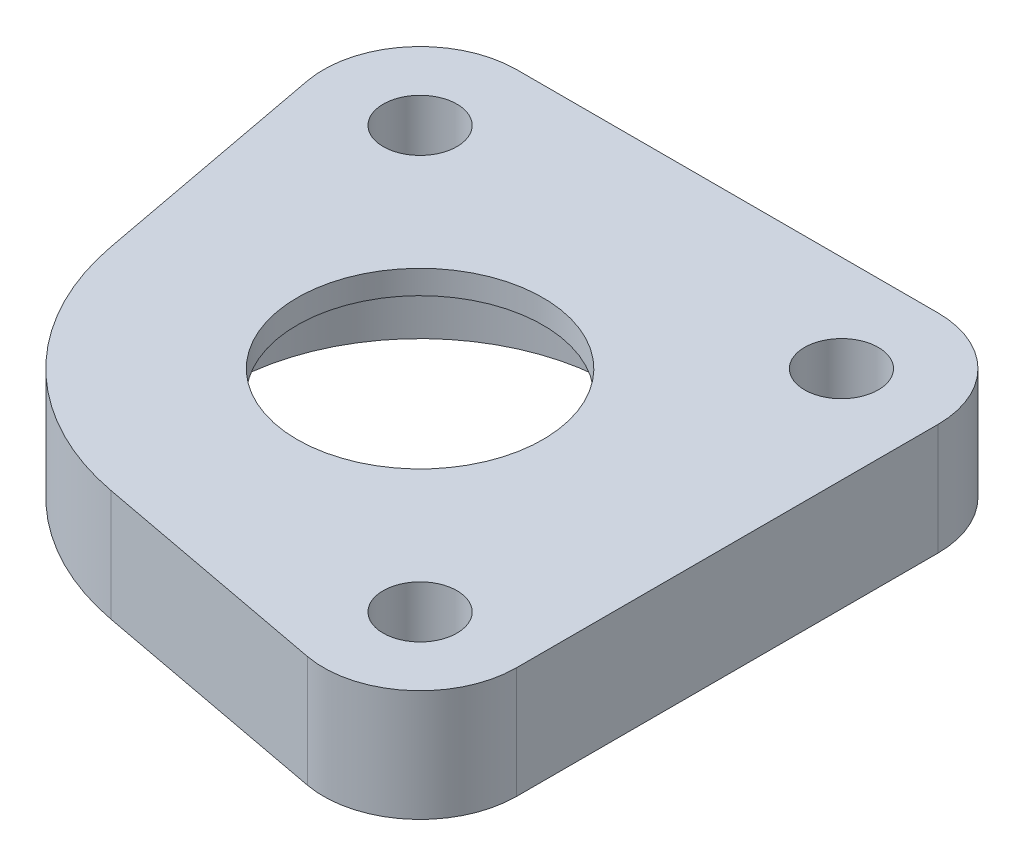
ISO-10303-21;
HEADER;
FILE_DESCRIPTION(('STEP AP214'),'2;1');
FILE_NAME('part.step','',(''),(''),'','','');
FILE_SCHEMA(('AUTOMOTIVE_DESIGN { 1 0 10303 214 1 1 1 1 }'));
ENDSEC;
DATA;
#1=APPLICATION_CONTEXT('core data for automotive mechanical design processes');
#2=APPLICATION_PROTOCOL_DEFINITION('international standard','automotive_design',2000,#1);
#3=PRODUCT_CONTEXT('',#1,'mechanical');
#4=PRODUCT('Part','Part','',(#3));
#5=PRODUCT_RELATED_PRODUCT_CATEGORY('part','',(#4));
#6=PRODUCT_DEFINITION_FORMATION('','',#4);
#7=PRODUCT_DEFINITION_CONTEXT('part definition',#1,'design');
#8=PRODUCT_DEFINITION('design','',#6,#7);
#9=PRODUCT_DEFINITION_SHAPE('','',#8);
#10=(LENGTH_UNIT() NAMED_UNIT(*) SI_UNIT(.MILLI.,.METRE.));
#11=(NAMED_UNIT(*) PLANE_ANGLE_UNIT() SI_UNIT($,.RADIAN.));
#12=(NAMED_UNIT(*) SI_UNIT($,.STERADIAN.) SOLID_ANGLE_UNIT());
#13=UNCERTAINTY_MEASURE_WITH_UNIT(LENGTH_MEASURE(1.E-05),#10,'distance_accuracy_value','');
#14=(GEOMETRIC_REPRESENTATION_CONTEXT(3) GLOBAL_UNCERTAINTY_ASSIGNED_CONTEXT((#13)) GLOBAL_UNIT_ASSIGNED_CONTEXT((#10,
#11,#12)) REPRESENTATION_CONTEXT('',''));
#15=CARTESIAN_POINT('',(0.,0.,0.));
#16=DIRECTION('',(0.,0.,1.));
#17=DIRECTION('',(1.,0.,0.));
#18=AXIS2_PLACEMENT_3D('',#15,#16,#17);
#19=CARTESIAN_POINT('',(12.,6.35,-12.));
#20=DIRECTION('',(0.,1.,0.));
#21=DIRECTION('',(0.,0.,1.));
#22=AXIS2_PLACEMENT_3D('',#19,#20,#21);
#23=PLANE('',#22);
#24=CARTESIAN_POINT('',(12.,6.35,-12.));
#25=DIRECTION('',(0.,1.,0.));
#26=DIRECTION('',(0.,0.,1.));
#27=AXIS2_PLACEMENT_3D('',#24,#25,#26);
#28=CIRCLE('',#27,2.09999999999999);
#29=CARTESIAN_POINT('',(12.,6.35,-9.90000000000001));
#30=VERTEX_POINT('',#29);
#31=EDGE_CURVE('E235',#30,#30,#28,.T.);
#32=ORIENTED_EDGE('',*,*,#31,.F.);
#33=EDGE_LOOP('',(#32));
#34=FACE_BOUND('',#33,.T.);
#35=CARTESIAN_POINT('',(12.,6.35,12.));
#36=DIRECTION('',(0.,1.,0.));
#37=DIRECTION('',(0.,0.,1.));
#38=AXIS2_PLACEMENT_3D('',#35,#36,#37);
#39=CIRCLE('',#38,2.09999999999999);
#40=CARTESIAN_POINT('',(12.,6.35,14.1));
#41=VERTEX_POINT('',#40);
#42=EDGE_CURVE('E229',#41,#41,#39,.T.);
#43=ORIENTED_EDGE('',*,*,#42,.F.);
#44=EDGE_LOOP('',(#43));
#45=FACE_BOUND('',#44,.T.);
#46=CARTESIAN_POINT('',(-12.,6.35,-12.));
#47=DIRECTION('',(0.,1.,0.));
#48=DIRECTION('',(0.,0.,1.));
#49=AXIS2_PLACEMENT_3D('',#46,#47,#48);
#50=CIRCLE('',#49,2.09999999999999);
#51=CARTESIAN_POINT('',(-12.,6.35,-9.90000000000001));
#52=VERTEX_POINT('',#51);
#53=EDGE_CURVE('E223',#52,#52,#50,.T.);
#54=ORIENTED_EDGE('',*,*,#53,.F.);
#55=EDGE_LOOP('',(#54));
#56=FACE_BOUND('',#55,.T.);
#57=DIRECTION('',(1.,0.,0.));
#58=VECTOR('',#57,1.);
#59=CARTESIAN_POINT('',(-12.,6.35,-17.5));
#60=LINE('',#59,#58);
#61=CARTESIAN_POINT('',(-12.,6.35,-17.5));
#62=VERTEX_POINT('',#61);
#63=CARTESIAN_POINT('',(12.,6.35,-17.5));
#64=VERTEX_POINT('',#63);
#65=EDGE_CURVE('E181',#62,#64,#60,.T.);
#66=ORIENTED_EDGE('',*,*,#65,.F.);
#67=CARTESIAN_POINT('',(-12.,6.35,-12.));
#68=DIRECTION('',(0.,1.,0.));
#69=DIRECTION('',(0.,0.,1.));
#70=AXIS2_PLACEMENT_3D('',#67,#68,#69);
#71=CIRCLE('',#70,5.5);
#72=CARTESIAN_POINT('',(-17.4052170349977,6.35,-10.983324631669));
#73=VERTEX_POINT('',#72);
#74=EDGE_CURVE('E139',#62,#73,#71,.T.);
#75=ORIENTED_EDGE('',*,*,#74,.T.);
#76=DIRECTION('',(0.184850066969274,0.,0.98276673363594));
#77=VECTOR('',#76,1.);
#78=CARTESIAN_POINT('',(-17.4052170349977,6.35,-10.983324631669));
#79=LINE('',#78,#77);
#80=CARTESIAN_POINT('',(-14.8152085095618,6.35,2.7866147595618));
#81=VERTEX_POINT('',#80);
#82=EDGE_CURVE('E132',#73,#81,#79,.T.);
#83=ORIENTED_EDGE('',*,*,#82,.T.);
#84=CARTESIAN_POINT('',(0.,6.35,0.));
#85=DIRECTION('',(0.,1.,0.));
#86=DIRECTION('',(0.,0.,1.));
#87=AXIS2_PLACEMENT_3D('',#84,#85,#86);
#88=CIRCLE('',#87,15.075);
#89=CARTESIAN_POINT('',(-2.7866147595618,6.35,14.8152085095618));
#90=VERTEX_POINT('',#89);
#91=EDGE_CURVE('E137',#81,#90,#88,.T.);
#92=ORIENTED_EDGE('',*,*,#91,.T.);
#93=DIRECTION('',(-0.98276673363594,0.,-0.184850066969274));
#94=VECTOR('',#93,1.);
#95=CARTESIAN_POINT('',(10.983324631669,6.35,17.4052170349977));
#96=LINE('',#95,#94);
#97=CARTESIAN_POINT('',(10.983324631669,6.35,17.4052170349977));
#98=VERTEX_POINT('',#97);
#99=EDGE_CURVE('E154',#98,#90,#96,.T.);
#100=ORIENTED_EDGE('',*,*,#99,.F.);
#101=CARTESIAN_POINT('',(12.,6.35,12.));
#102=DIRECTION('',(0.,1.,0.));
#103=DIRECTION('',(0.,0.,1.));
#104=AXIS2_PLACEMENT_3D('',#101,#102,#103);
#105=CIRCLE('',#104,5.5);
#106=CARTESIAN_POINT('',(17.5,6.35,12.));
#107=VERTEX_POINT('',#106);
#108=EDGE_CURVE('E156',#98,#107,#105,.T.);
#109=ORIENTED_EDGE('',*,*,#108,.T.);
#110=DIRECTION('',(0.,0.,1.));
#111=VECTOR('',#110,1.);
#112=CARTESIAN_POINT('',(17.5000000000001,6.35,-12.));
#113=LINE('',#112,#111);
#114=CARTESIAN_POINT('',(17.5000000000001,6.35,-12.));
#115=VERTEX_POINT('',#114);
#116=EDGE_CURVE('E203',#115,#107,#113,.T.);
#117=ORIENTED_EDGE('',*,*,#116,.F.);
#118=CARTESIAN_POINT('',(12.,6.35,-12.));
#119=DIRECTION('',(0.,1.,0.));
#120=DIRECTION('',(0.,0.,1.));
#121=AXIS2_PLACEMENT_3D('',#118,#119,#120);
#122=CIRCLE('',#121,5.50000000000003);
#123=EDGE_CURVE('E117',#115,#64,#122,.T.);
#124=ORIENTED_EDGE('',*,*,#123,.T.);
#125=EDGE_LOOP('',(#66,#75,#83,#92,#100,#109,#117,#124));
#126=FACE_BOUND('',#125,.T.);
#127=CARTESIAN_POINT('',(0.,6.35,0.));
#128=DIRECTION('',(0.,1.,0.));
#129=DIRECTION('',(0.,0.,1.));
#130=AXIS2_PLACEMENT_3D('',#127,#128,#129);
#131=CIRCLE('',#130,7.);
#132=CARTESIAN_POINT('',(0.,6.35,7.));
#133=VERTEX_POINT('',#132);
#134=EDGE_CURVE('E166',#133,#133,#131,.T.);
#135=ORIENTED_EDGE('',*,*,#134,.F.);
#136=EDGE_LOOP('',(#135));
#137=FACE_BOUND('',#136,.T.);
#138=ADVANCED_FACE('F61',(#34,#45,#56,#126,#137),#23,.T.);
#139=CARTESIAN_POINT('',(12.,0.,-12.));
#140=DIRECTION('',(0.,1.,0.));
#141=DIRECTION('',(0.,0.,1.));
#142=AXIS2_PLACEMENT_3D('',#139,#140,#141);
#143=PLANE('',#142);
#144=CARTESIAN_POINT('',(12.,0.,-12.));
#145=DIRECTION('',(0.,1.,0.));
#146=DIRECTION('',(0.,0.,1.));
#147=AXIS2_PLACEMENT_3D('',#144,#145,#146);
#148=CIRCLE('',#147,2.1);
#149=CARTESIAN_POINT('',(12.,0.,-9.9));
#150=VERTEX_POINT('',#149);
#151=EDGE_CURVE('E232',#150,#150,#148,.T.);
#152=ORIENTED_EDGE('',*,*,#151,.T.);
#153=EDGE_LOOP('',(#152));
#154=FACE_BOUND('',#153,.T.);
#155=CARTESIAN_POINT('',(12.,0.,12.));
#156=DIRECTION('',(0.,1.,0.));
#157=DIRECTION('',(0.,0.,1.));
#158=AXIS2_PLACEMENT_3D('',#155,#156,#157);
#159=CIRCLE('',#158,2.1);
#160=CARTESIAN_POINT('',(12.,0.,14.1));
#161=VERTEX_POINT('',#160);
#162=EDGE_CURVE('E226',#161,#161,#159,.T.);
#163=ORIENTED_EDGE('',*,*,#162,.T.);
#164=EDGE_LOOP('',(#163));
#165=FACE_BOUND('',#164,.T.);
#166=CARTESIAN_POINT('',(-12.,0.,-12.));
#167=DIRECTION('',(0.,1.,0.));
#168=DIRECTION('',(0.,0.,1.));
#169=AXIS2_PLACEMENT_3D('',#166,#167,#168);
#170=CIRCLE('',#169,2.1);
#171=CARTESIAN_POINT('',(-12.,0.,-9.9));
#172=VERTEX_POINT('',#171);
#173=EDGE_CURVE('E218',#172,#172,#170,.T.);
#174=ORIENTED_EDGE('',*,*,#173,.T.);
#175=EDGE_LOOP('',(#174));
#176=FACE_BOUND('',#175,.T.);
#177=CARTESIAN_POINT('',(0.,0.,0.));
#178=DIRECTION('',(0.,1.,0.));
#179=DIRECTION('',(0.,0.,1.));
#180=AXIS2_PLACEMENT_3D('',#177,#178,#179);
#181=CIRCLE('',#180,11.075);
#182=CARTESIAN_POINT('',(0.,0.,11.075));
#183=VERTEX_POINT('',#182);
#184=EDGE_CURVE('E214',#183,#183,#181,.T.);
#185=ORIENTED_EDGE('',*,*,#184,.T.);
#186=EDGE_LOOP('',(#185));
#187=FACE_BOUND('',#186,.T.);
#188=DIRECTION('',(1.,0.,0.));
#189=VECTOR('',#188,1.);
#190=CARTESIAN_POINT('',(-12.,0.,-17.5));
#191=LINE('',#190,#189);
#192=CARTESIAN_POINT('',(-12.,0.,-17.5));
#193=VERTEX_POINT('',#192);
#194=CARTESIAN_POINT('',(12.,0.,-17.5));
#195=VERTEX_POINT('',#194);
#196=EDGE_CURVE('E162',#193,#195,#191,.T.);
#197=ORIENTED_EDGE('',*,*,#196,.T.);
#198=CARTESIAN_POINT('',(12.,0.,-12.));
#199=DIRECTION('',(0.,1.,0.));
#200=DIRECTION('',(0.,0.,1.));
#201=AXIS2_PLACEMENT_3D('',#198,#199,#200);
#202=CIRCLE('',#201,5.50000000000003);
#203=CARTESIAN_POINT('',(17.5000000000001,0.,-12.));
#204=VERTEX_POINT('',#203);
#205=EDGE_CURVE('E165',#204,#195,#202,.T.);
#206=ORIENTED_EDGE('',*,*,#205,.F.);
#207=DIRECTION('',(0.,0.,1.));
#208=VECTOR('',#207,1.);
#209=CARTESIAN_POINT('',(17.5000000000001,0.,-12.));
#210=LINE('',#209,#208);
#211=CARTESIAN_POINT('',(17.5,0.,12.));
#212=VERTEX_POINT('',#211);
#213=EDGE_CURVE('E169',#204,#212,#210,.T.);
#214=ORIENTED_EDGE('',*,*,#213,.T.);
#215=CARTESIAN_POINT('',(12.,0.,12.));
#216=DIRECTION('',(0.,1.,0.));
#217=DIRECTION('',(0.,0.,1.));
#218=AXIS2_PLACEMENT_3D('',#215,#216,#217);
#219=CIRCLE('',#218,5.5);
#220=CARTESIAN_POINT('',(10.983324631669,0.,17.4052170349977));
#221=VERTEX_POINT('',#220);
#222=EDGE_CURVE('E172',#221,#212,#219,.T.);
#223=ORIENTED_EDGE('',*,*,#222,.F.);
#224=DIRECTION('',(-0.98276673363594,0.,-0.184850066969274));
#225=VECTOR('',#224,1.);
#226=CARTESIAN_POINT('',(10.983324631669,0.,17.4052170349977));
#227=LINE('',#226,#225);
#228=CARTESIAN_POINT('',(-2.7866147595618,0.,14.8152085095618));
#229=VERTEX_POINT('',#228);
#230=EDGE_CURVE('E175',#221,#229,#227,.T.);
#231=ORIENTED_EDGE('',*,*,#230,.T.);
#232=CARTESIAN_POINT('',(0.,0.,0.));
#233=DIRECTION('',(0.,1.,0.));
#234=DIRECTION('',(0.,0.,1.));
#235=AXIS2_PLACEMENT_3D('',#232,#233,#234);
#236=CIRCLE('',#235,15.075);
#237=CARTESIAN_POINT('',(-14.8152085095618,0.,2.7866147595618));
#238=VERTEX_POINT('',#237);
#239=EDGE_CURVE('E178',#238,#229,#236,.T.);
#240=ORIENTED_EDGE('',*,*,#239,.F.);
#241=DIRECTION('',(0.184850066969274,0.,0.98276673363594));
#242=VECTOR('',#241,1.);
#243=CARTESIAN_POINT('',(-17.4052170349977,0.,-10.983324631669));
#244=LINE('',#243,#242);
#245=CARTESIAN_POINT('',(-17.4052170349977,0.,-10.983324631669));
#246=VERTEX_POINT('',#245);
#247=EDGE_CURVE('E146',#246,#238,#244,.T.);
#248=ORIENTED_EDGE('',*,*,#247,.F.);
#249=CARTESIAN_POINT('',(-12.,0.,-12.));
#250=DIRECTION('',(0.,1.,0.));
#251=DIRECTION('',(0.,0.,1.));
#252=AXIS2_PLACEMENT_3D('',#249,#250,#251);
#253=CIRCLE('',#252,5.5);
#254=EDGE_CURVE('E107',#193,#246,#253,.T.);
#255=ORIENTED_EDGE('',*,*,#254,.F.);
#256=EDGE_LOOP('',(#197,#206,#214,#223,#231,#240,#248,#255));
#257=FACE_BOUND('',#256,.T.);
#258=ADVANCED_FACE('F195',(#154,#165,#176,#187,#257),#143,.F.);
#259=CARTESIAN_POINT('',(-12.,6.35,-17.5));
#260=DIRECTION('',(0.,0.,-1.));
#261=DIRECTION('',(-1.,0.,0.));
#262=AXIS2_PLACEMENT_3D('',#259,#260,#261);
#263=PLANE('',#262);
#264=ORIENTED_EDGE('',*,*,#196,.F.);
#265=DIRECTION('',(0.,-1.,0.));
#266=VECTOR('',#265,1.);
#267=CARTESIAN_POINT('',(-12.,6.35,-17.5));
#268=LINE('',#267,#266);
#269=EDGE_CURVE('E12',#62,#193,#268,.T.);
#270=ORIENTED_EDGE('',*,*,#269,.F.);
#271=ORIENTED_EDGE('',*,*,#65,.T.);
#272=DIRECTION('',(0.,-1.,0.));
#273=VECTOR('',#272,1.);
#274=CARTESIAN_POINT('',(12.,6.35,-17.5));
#275=LINE('',#274,#273);
#276=EDGE_CURVE('E161',#64,#195,#275,.T.);
#277=ORIENTED_EDGE('',*,*,#276,.T.);
#278=EDGE_LOOP('',(#264,#270,#271,#277));
#279=FACE_BOUND('',#278,.T.);
#280=ADVANCED_FACE('F63',(#279),#263,.T.);
#281=CARTESIAN_POINT('',(-12.,6.35,-12.));
#282=DIRECTION('',(0.,-1.,0.));
#283=DIRECTION('',(0.,0.,-1.));
#284=AXIS2_PLACEMENT_3D('',#281,#282,#283);
#285=CYLINDRICAL_SURFACE('',#284,5.5);
#286=ORIENTED_EDGE('',*,*,#254,.T.);
#287=DIRECTION('',(0.,-1.,0.));
#288=VECTOR('',#287,1.);
#289=CARTESIAN_POINT('',(-17.4052170349977,6.35,-10.983324631669));
#290=LINE('',#289,#288);
#291=EDGE_CURVE('E71',#73,#246,#290,.T.);
#292=ORIENTED_EDGE('',*,*,#291,.F.);
#293=ORIENTED_EDGE('',*,*,#74,.F.);
#294=ORIENTED_EDGE('',*,*,#269,.T.);
#295=EDGE_LOOP('',(#286,#292,#293,#294));
#296=FACE_BOUND('',#295,.T.);
#297=ADVANCED_FACE('F276',(#296),#285,.T.);
#298=CARTESIAN_POINT('',(-17.4052170349977,6.35,-10.983324631669));
#299=DIRECTION('',(0.98276673363594,0.,-0.184850066969274));
#300=DIRECTION('',(-0.184850066969274,0.,-0.98276673363594));
#301=AXIS2_PLACEMENT_3D('',#298,#299,#300);
#302=PLANE('',#301);
#303=ORIENTED_EDGE('',*,*,#247,.T.);
#304=DIRECTION('',(0.,-1.,0.));
#305=VECTOR('',#304,1.);
#306=CARTESIAN_POINT('',(-14.8152085095618,6.35,2.7866147595618));
#307=LINE('',#306,#305);
#308=EDGE_CURVE('E143',#81,#238,#307,.T.);
#309=ORIENTED_EDGE('',*,*,#308,.F.);
#310=ORIENTED_EDGE('',*,*,#82,.F.);
#311=ORIENTED_EDGE('',*,*,#291,.T.);
#312=EDGE_LOOP('',(#303,#309,#310,#311));
#313=FACE_BOUND('',#312,.T.);
#314=ADVANCED_FACE('F144',(#313),#302,.F.);
#315=CARTESIAN_POINT('',(0.,6.35,0.));
#316=DIRECTION('',(0.,-1.,0.));
#317=DIRECTION('',(0.,0.,-1.));
#318=AXIS2_PLACEMENT_3D('',#315,#316,#317);
#319=CYLINDRICAL_SURFACE('',#318,15.075);
#320=ORIENTED_EDGE('',*,*,#239,.T.);
#321=DIRECTION('',(0.,-1.,0.));
#322=VECTOR('',#321,1.);
#323=CARTESIAN_POINT('',(-2.7866147595618,6.35,14.8152085095618));
#324=LINE('',#323,#322);
#325=EDGE_CURVE('E150',#90,#229,#324,.T.);
#326=ORIENTED_EDGE('',*,*,#325,.F.);
#327=ORIENTED_EDGE('',*,*,#91,.F.);
#328=ORIENTED_EDGE('',*,*,#308,.T.);
#329=EDGE_LOOP('',(#320,#326,#327,#328));
#330=FACE_BOUND('',#329,.T.);
#331=ADVANCED_FACE('F152',(#330),#319,.T.);
#332=CARTESIAN_POINT('',(10.983324631669,6.35,17.4052170349977));
#333=DIRECTION('',(-0.184850066969274,0.,0.98276673363594));
#334=DIRECTION('',(0.98276673363594,0.,0.184850066969274));
#335=AXIS2_PLACEMENT_3D('',#332,#333,#334);
#336=PLANE('',#335);
#337=ORIENTED_EDGE('',*,*,#230,.F.);
#338=DIRECTION('',(0.,-1.,0.));
#339=VECTOR('',#338,1.);
#340=CARTESIAN_POINT('',(10.983324631669,6.35,17.4052170349977));
#341=LINE('',#340,#339);
#342=EDGE_CURVE('E185',#98,#221,#341,.T.);
#343=ORIENTED_EDGE('',*,*,#342,.F.);
#344=ORIENTED_EDGE('',*,*,#99,.T.);
#345=ORIENTED_EDGE('',*,*,#325,.T.);
#346=EDGE_LOOP('',(#337,#343,#344,#345));
#347=FACE_BOUND('',#346,.T.);
#348=ADVANCED_FACE('F199',(#347),#336,.T.);
#349=CARTESIAN_POINT('',(12.,6.35,12.));
#350=DIRECTION('',(0.,-1.,0.));
#351=DIRECTION('',(0.,0.,-1.));
#352=AXIS2_PLACEMENT_3D('',#349,#350,#351);
#353=CYLINDRICAL_SURFACE('',#352,5.5);
#354=ORIENTED_EDGE('',*,*,#222,.T.);
#355=DIRECTION('',(0.,-1.,0.));
#356=VECTOR('',#355,1.);
#357=CARTESIAN_POINT('',(17.5,6.35,12.));
#358=LINE('',#357,#356);
#359=EDGE_CURVE('E187',#107,#212,#358,.T.);
#360=ORIENTED_EDGE('',*,*,#359,.F.);
#361=ORIENTED_EDGE('',*,*,#108,.F.);
#362=ORIENTED_EDGE('',*,*,#342,.T.);
#363=EDGE_LOOP('',(#354,#360,#361,#362));
#364=FACE_BOUND('',#363,.T.);
#365=ADVANCED_FACE('F205',(#364),#353,.T.);
#366=CARTESIAN_POINT('',(17.5000000000001,6.35,-12.));
#367=DIRECTION('',(1.,0.,0.));
#368=DIRECTION('',(0.,0.,-1.));
#369=AXIS2_PLACEMENT_3D('',#366,#367,#368);
#370=PLANE('',#369);
#371=ORIENTED_EDGE('',*,*,#213,.F.);
#372=DIRECTION('',(0.,-1.,0.));
#373=VECTOR('',#372,1.);
#374=CARTESIAN_POINT('',(17.5000000000001,6.35,-12.));
#375=LINE('',#374,#373);
#376=EDGE_CURVE('E189',#115,#204,#375,.T.);
#377=ORIENTED_EDGE('',*,*,#376,.F.);
#378=ORIENTED_EDGE('',*,*,#116,.T.);
#379=ORIENTED_EDGE('',*,*,#359,.T.);
#380=EDGE_LOOP('',(#371,#377,#378,#379));
#381=FACE_BOUND('',#380,.T.);
#382=ADVANCED_FACE('F207',(#381),#370,.T.);
#383=CARTESIAN_POINT('',(12.,6.35,-12.));
#384=DIRECTION('',(0.,-1.,0.));
#385=DIRECTION('',(0.,0.,-1.));
#386=AXIS2_PLACEMENT_3D('',#383,#384,#385);
#387=CYLINDRICAL_SURFACE('',#386,5.50000000000003);
#388=ORIENTED_EDGE('',*,*,#205,.T.);
#389=ORIENTED_EDGE('',*,*,#276,.F.);
#390=ORIENTED_EDGE('',*,*,#123,.F.);
#391=ORIENTED_EDGE('',*,*,#376,.T.);
#392=EDGE_LOOP('',(#388,#389,#390,#391));
#393=FACE_BOUND('',#392,.T.);
#394=ADVANCED_FACE('F192',(#393),#387,.T.);
#395=CARTESIAN_POINT('',(0.,6.35,0.));
#396=DIRECTION('',(0.,-1.,0.));
#397=DIRECTION('',(0.,0.,-1.));
#398=AXIS2_PLACEMENT_3D('',#395,#396,#397);
#399=CYLINDRICAL_SURFACE('',#398,7.);
#400=CARTESIAN_POINT('',(0.,5.,0.));
#401=DIRECTION('',(0.,1.,0.));
#402=DIRECTION('',(0.,0.,1.));
#403=AXIS2_PLACEMENT_3D('',#400,#401,#402);
#404=CIRCLE('',#403,7.);
#405=CARTESIAN_POINT('',(0.,5.,7.));
#406=VERTEX_POINT('',#405);
#407=EDGE_CURVE('E65',#406,#406,#404,.T.);
#408=ORIENTED_EDGE('',*,*,#407,.F.);
#409=EDGE_LOOP('',(#408));
#410=FACE_BOUND('',#409,.T.);
#411=ORIENTED_EDGE('',*,*,#134,.T.);
#412=EDGE_LOOP('',(#411));
#413=FACE_BOUND('',#412,.T.);
#414=ADVANCED_FACE('F268',(#410,#413),#399,.F.);
#415=CARTESIAN_POINT('',(0.,5.,0.));
#416=DIRECTION('',(0.,-1.,0.));
#417=DIRECTION('',(0.,0.,-1.));
#418=AXIS2_PLACEMENT_3D('',#415,#416,#417);
#419=CYLINDRICAL_SURFACE('',#418,11.075);
#420=CARTESIAN_POINT('',(0.,5.,0.));
#421=DIRECTION('',(0.,1.,0.));
#422=DIRECTION('',(0.,0.,1.));
#423=AXIS2_PLACEMENT_3D('',#420,#421,#422);
#424=CIRCLE('',#423,11.075);
#425=CARTESIAN_POINT('',(0.,5.,11.075));
#426=VERTEX_POINT('',#425);
#427=EDGE_CURVE('E217',#426,#426,#424,.T.);
#428=ORIENTED_EDGE('',*,*,#427,.T.);
#429=EDGE_LOOP('',(#428));
#430=FACE_BOUND('',#429,.T.);
#431=ORIENTED_EDGE('',*,*,#184,.F.);
#432=EDGE_LOOP('',(#431));
#433=FACE_BOUND('',#432,.T.);
#434=ADVANCED_FACE('F260',(#430,#433),#419,.F.);
#435=CARTESIAN_POINT('',(0.,5.,0.));
#436=DIRECTION('',(0.,1.,0.));
#437=DIRECTION('',(0.,0.,1.));
#438=AXIS2_PLACEMENT_3D('',#435,#436,#437);
#439=PLANE('',#438);
#440=ORIENTED_EDGE('',*,*,#407,.T.);
#441=EDGE_LOOP('',(#440));
#442=FACE_BOUND('',#441,.T.);
#443=ORIENTED_EDGE('',*,*,#427,.F.);
#444=EDGE_LOOP('',(#443));
#445=FACE_BOUND('',#444,.T.);
#446=ADVANCED_FACE('F251',(#442,#445),#439,.F.);
#447=CARTESIAN_POINT('',(-12.,6.35,-12.));
#448=DIRECTION('',(0.,1.,0.));
#449=DIRECTION('',(0.,0.,1.));
#450=AXIS2_PLACEMENT_3D('',#447,#448,#449);
#451=CYLINDRICAL_SURFACE('',#450,2.09999999999999);
#452=ORIENTED_EDGE('',*,*,#173,.F.);
#453=EDGE_LOOP('',(#452));
#454=FACE_BOUND('',#453,.T.);
#455=ORIENTED_EDGE('',*,*,#53,.T.);
#456=EDGE_LOOP('',(#455));
#457=FACE_BOUND('',#456,.T.);
#458=ADVANCED_FACE('F248',(#454,#457),#451,.F.);
#459=CARTESIAN_POINT('',(12.,6.35,12.));
#460=DIRECTION('',(0.,1.,0.));
#461=DIRECTION('',(0.,0.,1.));
#462=AXIS2_PLACEMENT_3D('',#459,#460,#461);
#463=CYLINDRICAL_SURFACE('',#462,2.09999999999999);
#464=ORIENTED_EDGE('',*,*,#162,.F.);
#465=EDGE_LOOP('',(#464));
#466=FACE_BOUND('',#465,.T.);
#467=ORIENTED_EDGE('',*,*,#42,.T.);
#468=EDGE_LOOP('',(#467));
#469=FACE_BOUND('',#468,.T.);
#470=ADVANCED_FACE('F250',(#466,#469),#463,.F.);
#471=CARTESIAN_POINT('',(12.,6.35,-12.));
#472=DIRECTION('',(0.,1.,0.));
#473=DIRECTION('',(0.,0.,1.));
#474=AXIS2_PLACEMENT_3D('',#471,#472,#473);
#475=CYLINDRICAL_SURFACE('',#474,2.09999999999999);
#476=ORIENTED_EDGE('',*,*,#151,.F.);
#477=EDGE_LOOP('',(#476));
#478=FACE_BOUND('',#477,.T.);
#479=ORIENTED_EDGE('',*,*,#31,.T.);
#480=EDGE_LOOP('',(#479));
#481=FACE_BOUND('',#480,.T.);
#482=ADVANCED_FACE('F239',(#478,#481),#475,.F.);
#483=CLOSED_SHELL('',(#138,#258,#280,#297,#314,#331,#348,#365,#382,#394,#414,#434,#446,#458,
#470,#482));
#484=MANIFOLD_SOLID_BREP('B2',#483);
#485=ADVANCED_BREP_SHAPE_REPRESENTATION('',(#18,#484),#14);
#486=SHAPE_DEFINITION_REPRESENTATION(#9,#485);
ENDSEC;
END-ISO-10303-21;
